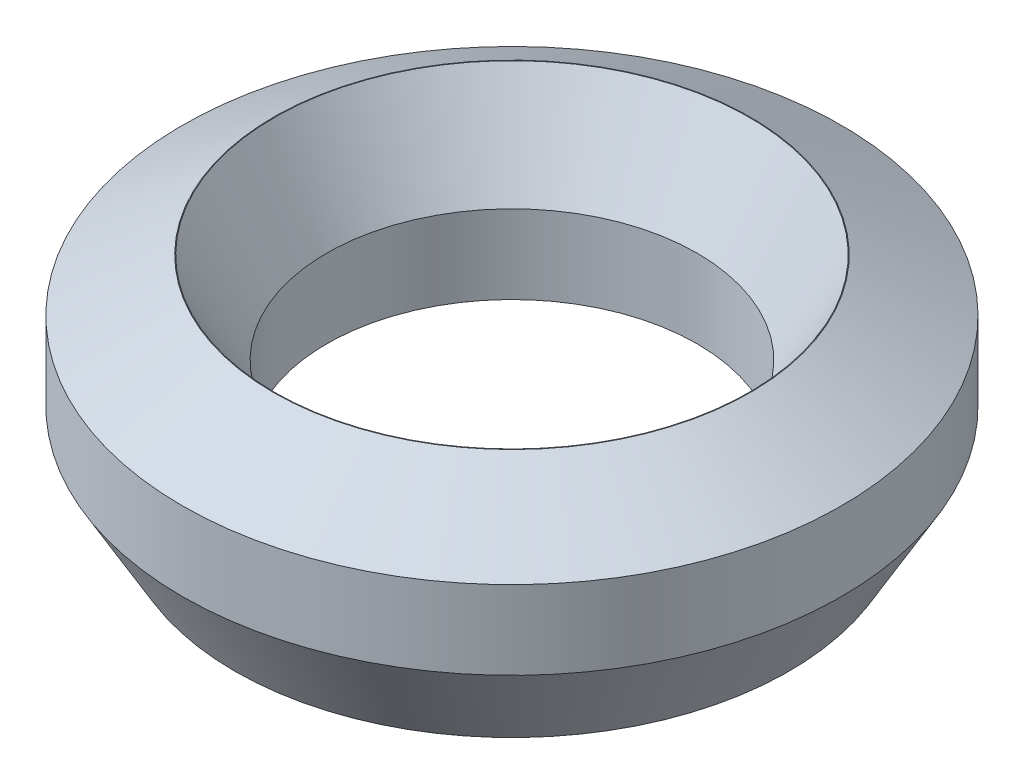
ISO-10303-21;
HEADER;
FILE_DESCRIPTION(('STEP AP214'),'2;1');
FILE_NAME('part.step','',(''),(''),'','','');
FILE_SCHEMA(('AUTOMOTIVE_DESIGN { 1 0 10303 214 1 1 1 1 }'));
ENDSEC;
DATA;
#1=APPLICATION_CONTEXT('core data for automotive mechanical design processes');
#2=APPLICATION_PROTOCOL_DEFINITION('international standard','automotive_design',2000,#1);
#3=PRODUCT_CONTEXT('',#1,'mechanical');
#4=PRODUCT('Part','Part','',(#3));
#5=PRODUCT_RELATED_PRODUCT_CATEGORY('part','',(#4));
#6=PRODUCT_DEFINITION_FORMATION('','',#4);
#7=PRODUCT_DEFINITION_CONTEXT('part definition',#1,'design');
#8=PRODUCT_DEFINITION('design','',#6,#7);
#9=PRODUCT_DEFINITION_SHAPE('','',#8);
#10=(LENGTH_UNIT() NAMED_UNIT(*) SI_UNIT(.MILLI.,.METRE.));
#11=(NAMED_UNIT(*) PLANE_ANGLE_UNIT() SI_UNIT($,.RADIAN.));
#12=(NAMED_UNIT(*) SI_UNIT($,.STERADIAN.) SOLID_ANGLE_UNIT());
#13=UNCERTAINTY_MEASURE_WITH_UNIT(LENGTH_MEASURE(1.E-05),#10,'distance_accuracy_value','');
#14=(GEOMETRIC_REPRESENTATION_CONTEXT(3) GLOBAL_UNCERTAINTY_ASSIGNED_CONTEXT((#13)) GLOBAL_UNIT_ASSIGNED_CONTEXT((#10,
#11,#12)) REPRESENTATION_CONTEXT('',''));
#15=CARTESIAN_POINT('',(0.,0.,0.));
#16=DIRECTION('',(0.,0.,1.));
#17=DIRECTION('',(1.,0.,0.));
#18=AXIS2_PLACEMENT_3D('',#15,#16,#17);
#19=CARTESIAN_POINT('',(0.,11.8010399469779,0.));
#20=DIRECTION('',(0.,-1.,0.));
#21=DIRECTION('',(0.,0.,-1.));
#22=AXIS2_PLACEMENT_3D('',#19,#20,#21);
#23=CYLINDRICAL_SURFACE('',#22,17.5);
#24=CARTESIAN_POINT('',(0.,4.83726151298953,0.));
#25=DIRECTION('',(0.,1.,0.));
#26=DIRECTION('',(0.,0.,1.));
#27=AXIS2_PLACEMENT_3D('',#24,#25,#26);
#28=CIRCLE('',#27,17.5);
#29=CARTESIAN_POINT('',(0.,4.83726151298953,17.5));
#30=VERTEX_POINT('',#29);
#31=EDGE_CURVE('E10',#30,#30,#28,.T.);
#32=ORIENTED_EDGE('',*,*,#31,.T.);
#33=EDGE_LOOP('',(#32));
#34=FACE_BOUND('',#33,.T.);
#35=CARTESIAN_POINT('',(0.,9.0082457103127,0.));
#36=DIRECTION('',(0.,1.,0.));
#37=DIRECTION('',(0.,0.,1.));
#38=AXIS2_PLACEMENT_3D('',#35,#36,#37);
#39=CIRCLE('',#38,17.5);
#40=CARTESIAN_POINT('',(0.,9.0082457103127,17.5));
#41=VERTEX_POINT('',#40);
#42=EDGE_CURVE('E50',#41,#41,#39,.F.);
#43=ORIENTED_EDGE('',*,*,#42,.T.);
#44=EDGE_LOOP('',(#43));
#45=FACE_BOUND('',#44,.T.);
#46=ADVANCED_FACE('F39',(#34,#45),#23,.T.);
#47=CARTESIAN_POINT('',(0.,11.8010399469779,0.));
#48=DIRECTION('',(0.,1.,0.));
#49=DIRECTION('',(0.,0.,1.));
#50=AXIS2_PLACEMENT_3D('',#47,#48,#49);
#51=PLANE('',#50);
#52=CARTESIAN_POINT('',(0.,11.8010399469779,0.));
#53=DIRECTION('',(0.,1.,0.));
#54=DIRECTION('',(0.,0.,1.));
#55=AXIS2_PLACEMENT_3D('',#52,#53,#54);
#56=CIRCLE('',#55,12.6257424849858);
#57=CARTESIAN_POINT('',(0.,11.8010399469779,12.6257424849858));
#58=VERTEX_POINT('',#57);
#59=EDGE_CURVE('E58',#58,#58,#56,.F.);
#60=ORIENTED_EDGE('',*,*,#59,.T.);
#61=EDGE_LOOP('',(#60));
#62=FACE_BOUND('',#61,.T.);
#63=CARTESIAN_POINT('',(0.,11.8010399469779,0.));
#64=DIRECTION('',(0.,1.,0.));
#65=DIRECTION('',(0.,0.,1.));
#66=AXIS2_PLACEMENT_3D('',#63,#64,#65);
#67=CIRCLE('',#66,12.6627384870105);
#68=CARTESIAN_POINT('',(0.,11.8010399469779,12.6627384870105));
#69=VERTEX_POINT('',#68);
#70=EDGE_CURVE('E61',#69,#69,#67,.T.);
#71=ORIENTED_EDGE('',*,*,#70,.T.);
#72=EDGE_LOOP('',(#71));
#73=FACE_BOUND('',#72,.T.);
#74=ADVANCED_FACE('F88',(#62,#73),#51,.T.);
#75=CARTESIAN_POINT('',(0.,0.,0.));
#76=DIRECTION('',(0.,1.,0.));
#77=DIRECTION('',(0.,0.,1.));
#78=AXIS2_PLACEMENT_3D('',#75,#76,#77);
#79=PLANE('',#78);
#80=CARTESIAN_POINT('',(0.,0.,0.));
#81=DIRECTION('',(0.,1.,0.));
#82=DIRECTION('',(0.,0.,1.));
#83=AXIS2_PLACEMENT_3D('',#80,#81,#82);
#84=CIRCLE('',#83,14.6702097613102);
#85=CARTESIAN_POINT('',(0.,0.,14.6702097613102));
#86=VERTEX_POINT('',#85);
#87=EDGE_CURVE('E51',#86,#86,#84,.T.);
#88=ORIENTED_EDGE('',*,*,#87,.T.);
#89=EDGE_LOOP('',(#88));
#90=FACE_BOUND('',#89,.T.);
#91=CARTESIAN_POINT('',(0.,0.,0.));
#92=DIRECTION('',(0.,1.,0.));
#93=DIRECTION('',(0.,0.,1.));
#94=AXIS2_PLACEMENT_3D('',#91,#92,#93);
#95=CIRCLE('',#94,14.7072057633349);
#96=CARTESIAN_POINT('',(0.,0.,14.7072057633349));
#97=VERTEX_POINT('',#96);
#98=EDGE_CURVE('E54',#97,#97,#95,.F.);
#99=ORIENTED_EDGE('',*,*,#98,.T.);
#100=EDGE_LOOP('',(#99));
#101=FACE_BOUND('',#100,.T.);
#102=ADVANCED_FACE('F83',(#90,#101),#79,.F.);
#103=CARTESIAN_POINT('',(0.,11.8010399469779,0.));
#104=DIRECTION('',(0.,-1.,0.));
#105=DIRECTION('',(0.,0.,-1.));
#106=AXIS2_PLACEMENT_3D('',#103,#104,#105);
#107=CYLINDRICAL_SURFACE('',#106,9.83294824832068);
#108=CARTESIAN_POINT('',(0.,6.96377843398831,0.));
#109=DIRECTION('',(0.,1.,0.));
#110=DIRECTION('',(0.,0.,1.));
#111=AXIS2_PLACEMENT_3D('',#108,#109,#110);
#112=CIRCLE('',#111,9.83294824832068);
#113=CARTESIAN_POINT('',(0.,6.96377843398831,9.83294824832068));
#114=VERTEX_POINT('',#113);
#115=EDGE_CURVE('E67',#114,#114,#112,.T.);
#116=ORIENTED_EDGE('',*,*,#115,.T.);
#117=EDGE_LOOP('',(#116));
#118=FACE_BOUND('',#117,.T.);
#119=CARTESIAN_POINT('',(0.,2.79279423666515,0.));
#120=DIRECTION('',(0.,1.,0.));
#121=DIRECTION('',(0.,0.,1.));
#122=AXIS2_PLACEMENT_3D('',#119,#120,#121);
#123=CIRCLE('',#122,9.83294824832068);
#124=CARTESIAN_POINT('',(0.,2.79279423666515,9.83294824832068));
#125=VERTEX_POINT('',#124);
#126=EDGE_CURVE('E69',#125,#125,#123,.F.);
#127=ORIENTED_EDGE('',*,*,#126,.T.);
#128=EDGE_LOOP('',(#127));
#129=FACE_BOUND('',#128,.T.);
#130=ADVANCED_FACE('F71',(#118,#129),#107,.F.);
#131=CARTESIAN_POINT('',(0.,6.96377843398831,0.));
#132=DIRECTION('',(0.,1.,0.));
#133=DIRECTION('',(0.,0.,1.));
#134=AXIS2_PLACEMENT_3D('',#131,#132,#133);
#135=CONICAL_SURFACE('',#134,9.83294824832068,0.523598775598303);
#136=ORIENTED_EDGE('',*,*,#59,.F.);
#137=EDGE_LOOP('',(#136));
#138=FACE_BOUND('',#137,.T.);
#139=ORIENTED_EDGE('',*,*,#115,.F.);
#140=EDGE_LOOP('',(#139));
#141=FACE_BOUND('',#140,.T.);
#142=ADVANCED_FACE('F77',(#138,#141),#135,.F.);
#143=CARTESIAN_POINT('',(0.,0.,0.));
#144=DIRECTION('',(0.,-1.,0.));
#145=DIRECTION('',(0.,0.,-1.));
#146=AXIS2_PLACEMENT_3D('',#143,#144,#145);
#147=CONICAL_SURFACE('',#146,14.6702097613102,1.04719755119659);
#148=ORIENTED_EDGE('',*,*,#126,.F.);
#149=EDGE_LOOP('',(#148));
#150=FACE_BOUND('',#149,.T.);
#151=ORIENTED_EDGE('',*,*,#87,.F.);
#152=EDGE_LOOP('',(#151));
#153=FACE_BOUND('',#152,.T.);
#154=ADVANCED_FACE('F73',(#150,#153),#147,.F.);
#155=CARTESIAN_POINT('',(0.,4.83726151298953,0.));
#156=DIRECTION('',(0.,1.,0.));
#157=DIRECTION('',(0.,0.,1.));
#158=AXIS2_PLACEMENT_3D('',#155,#156,#157);
#159=CONICAL_SURFACE('',#158,17.5,0.523598775598302);
#160=CARTESIAN_POINT('',(0.,0.,14.7072057633349));
#161=CARTESIAN_POINT('',(0.,0.0503881407603063,14.7362973699668));
#162=CARTESIAN_POINT('',(0.,0.100776281520614,14.7653889765987));
#163=CARTESIAN_POINT('',(0.,0.20155256304123,14.8235721898626));
#164=CARTESIAN_POINT('',(0.,0.251940703801537,14.8526637964945));
#165=CARTESIAN_POINT('',(0.,0.352716985322153,14.9108470097584));
#166=CARTESIAN_POINT('',(0.,0.40310512608246,14.9399386163903));
#167=CARTESIAN_POINT('',(0.,0.503881407603075,14.9981218296541));
#168=CARTESIAN_POINT('',(0.,0.554269548363383,15.0272134362861));
#169=CARTESIAN_POINT('',(0.,0.655045829883999,15.0853966495499));
#170=CARTESIAN_POINT('',(0.,0.705433970644306,15.1144882561819));
#171=CARTESIAN_POINT('',(0.,0.806210252164921,15.1726714694457));
#172=CARTESIAN_POINT('',(0.,0.856598392925229,15.2017630760776));
#173=CARTESIAN_POINT('',(0.,0.957374674445844,15.2599462893415));
#174=CARTESIAN_POINT('',(0.,1.00776281520615,15.2890378959734));
#175=CARTESIAN_POINT('',(0.,1.10853909672677,15.3472211092373));
#176=CARTESIAN_POINT('',(0.,1.15892723748707,15.3763127158692));
#177=CARTESIAN_POINT('',(0.,1.25970351900769,15.4344959291331));
#178=CARTESIAN_POINT('',(0.,1.310091659768,15.463587535765));
#179=CARTESIAN_POINT('',(0.,1.41086794128861,15.5217707490289));
#180=CARTESIAN_POINT('',(0.,1.46125608204892,15.5508623556608));
#181=CARTESIAN_POINT('',(0.,1.56203236356954,15.6090455689246));
#182=CARTESIAN_POINT('',(0.,1.61242050432984,15.6381371755566));
#183=CARTESIAN_POINT('',(0.,1.71319678585046,15.6963203888204));
#184=CARTESIAN_POINT('',(0.,1.76358492661077,15.7254119954524));
#185=CARTESIAN_POINT('',(0.,1.86436120813138,15.7835952087162));
#186=CARTESIAN_POINT('',(0.,1.91474934889169,15.8126868153481));
#187=CARTESIAN_POINT('',(0.,2.0155256304123,15.870870028612));
#188=CARTESIAN_POINT('',(0.,2.06591377117261,15.8999616352439));
#189=CARTESIAN_POINT('',(0.,2.16669005269323,15.9581448485078));
#190=CARTESIAN_POINT('',(0.,2.21707819345353,15.9872364551397));
#191=CARTESIAN_POINT('',(0.,2.31785447497415,16.0454196684036));
#192=CARTESIAN_POINT('',(0.,2.36824261573446,16.0745112750355));
#193=CARTESIAN_POINT('',(0.,2.46901889725507,16.1326944882994));
#194=CARTESIAN_POINT('',(0.,2.51940703801538,16.1617860949313));
#195=CARTESIAN_POINT('',(0.,2.620183319536,16.2199693081951));
#196=CARTESIAN_POINT('',(0.,2.6705714602963,16.2490609148271));
#197=CARTESIAN_POINT('',(0.,2.77134774181692,16.3072441280909));
#198=CARTESIAN_POINT('',(0.,2.82173588257723,16.3363357347229));
#199=CARTESIAN_POINT('',(0.,2.92251216409784,16.3945189479867));
#200=CARTESIAN_POINT('',(0.,2.97290030485815,16.4236105546186));
#201=CARTESIAN_POINT('',(0.,3.07367658637876,16.4817937678825));
#202=CARTESIAN_POINT('',(0.,3.12406472713907,16.5108853745144));
#203=CARTESIAN_POINT('',(0.,3.22484100865969,16.5690685877783));
#204=CARTESIAN_POINT('',(0.,3.27522914941999,16.5981601944102));
#205=CARTESIAN_POINT('',(0.,3.37600543094061,16.6563434076741));
#206=CARTESIAN_POINT('',(0.,3.42639357170092,16.685435014306));
#207=CARTESIAN_POINT('',(0.,3.52716985322153,16.7436182275699));
#208=CARTESIAN_POINT('',(0.,3.57755799398184,16.7727098342018));
#209=CARTESIAN_POINT('',(0.,3.67833427550246,16.8308930474656));
#210=CARTESIAN_POINT('',(0.,3.72872241626276,16.8599846540976));
#211=CARTESIAN_POINT('',(0.,3.82949869778338,16.9181678673614));
#212=CARTESIAN_POINT('',(0.,3.87988683854369,16.9472594739934));
#213=CARTESIAN_POINT('',(0.,3.9806631200643,17.0054426872572));
#214=CARTESIAN_POINT('',(0.,4.03105126082461,17.0345342938891));
#215=CARTESIAN_POINT('',(0.,4.13182754234522,17.092717507153));
#216=CARTESIAN_POINT('',(0.,4.18221568310553,17.1218091137849));
#217=CARTESIAN_POINT('',(0.,4.28299196462615,17.1799923270488));
#218=CARTESIAN_POINT('',(0.,4.33338010538645,17.2090839336807));
#219=CARTESIAN_POINT('',(0.,4.43415638690707,17.2672671469446));
#220=CARTESIAN_POINT('',(0.,4.48454452766738,17.2963587535765));
#221=CARTESIAN_POINT('',(0.,4.58532080918799,17.3545419668404));
#222=CARTESIAN_POINT('',(0.,4.6357089499483,17.3836335734723));
#223=CARTESIAN_POINT('',(0.,4.73648523146892,17.4418167867362));
#224=CARTESIAN_POINT('',(0.,4.78687337222922,17.4709083933681));
#225=CARTESIAN_POINT('',(0.,4.83726151298953,17.5));
#226=B_SPLINE_CURVE_WITH_KNOTS('',3,(#160,#161,#162,#163,#164,#165,#166,#167,#168,#169,#170,
#171,#172,#173,#174,#175,#176,#177,#178,#179,#180,#181,#182,#183,#184,#185,#186,#187,#188,#189,
#190,#191,#192,#193,#194,#195,#196,#197,#198,#199,#200,#201,#202,#203,#204,#205,#206,#207,#208,
#209,#210,#211,#212,#213,#214,#215,#216,#217,#218,#219,#220,#221,#222,#223,#224,#225),
.UNSPECIFIED.,.F.,.F.,(4,2,2,2,2,2,2,2,2,2,2,2,2,2,2,2,2,2,2,2,2,2,2,2,2,2,2,2,2,2,2,2,4),(0.,
0.17454963979157,0.34909927958314,0.523648919374711,0.698198559166283,0.872748198957852,
1.04729783874942,1.22184747854099,1.39639711833256,1.57094675812413,1.7454963979157,
1.92004603770727,2.09459567749884,2.26914531729042,2.44369495708199,2.61824459687356,
2.79279423666513,2.9673438764567,3.14189351624827,3.31644315603984,3.49099279583141,
3.66554243562298,3.84009207541455,4.01464171520612,4.18919135499769,4.36374099478926,
4.53829063458083,4.71284027437241,4.88738991416398,5.06193955395555,5.23648919374712,
5.41103883353869,5.58558847333026),.UNSPECIFIED.);
#227=EDGE_CURVE('BSEAM76',#97,#30,#226,.T.);
#228=ORIENTED_EDGE('',*,*,#98,.F.);
#229=ORIENTED_EDGE('',*,*,#31,.F.);
#230=ORIENTED_EDGE('',*,*,#227,.T.);
#231=ORIENTED_EDGE('',*,*,#227,.F.);
#232=EDGE_LOOP('',(#228,#230,#229,#231));
#233=FACE_BOUND('',#232,.T.);
#234=ADVANCED_FACE('F76',(#233),#159,.T.);
#235=CARTESIAN_POINT('',(0.,11.8010399469779,0.));
#236=DIRECTION('',(0.,-1.,0.));
#237=DIRECTION('',(0.,0.,-1.));
#238=AXIS2_PLACEMENT_3D('',#235,#236,#237);
#239=CONICAL_SURFACE('',#238,12.6627384870105,1.04719755119659);
#240=ORIENTED_EDGE('',*,*,#42,.F.);
#241=EDGE_LOOP('',(#240));
#242=FACE_BOUND('',#241,.T.);
#243=ORIENTED_EDGE('',*,*,#70,.F.);
#244=EDGE_LOOP('',(#243));
#245=FACE_BOUND('',#244,.T.);
#246=ADVANCED_FACE('F45',(#242,#245),#239,.T.);
#247=CLOSED_SHELL('',(#46,#74,#102,#130,#142,#154,#234,#246));
#248=MANIFOLD_SOLID_BREP('B2',#247);
#249=ADVANCED_BREP_SHAPE_REPRESENTATION('',(#18,#248),#14);
#250=SHAPE_DEFINITION_REPRESENTATION(#9,#249);
ENDSEC;
END-ISO-10303-21;
